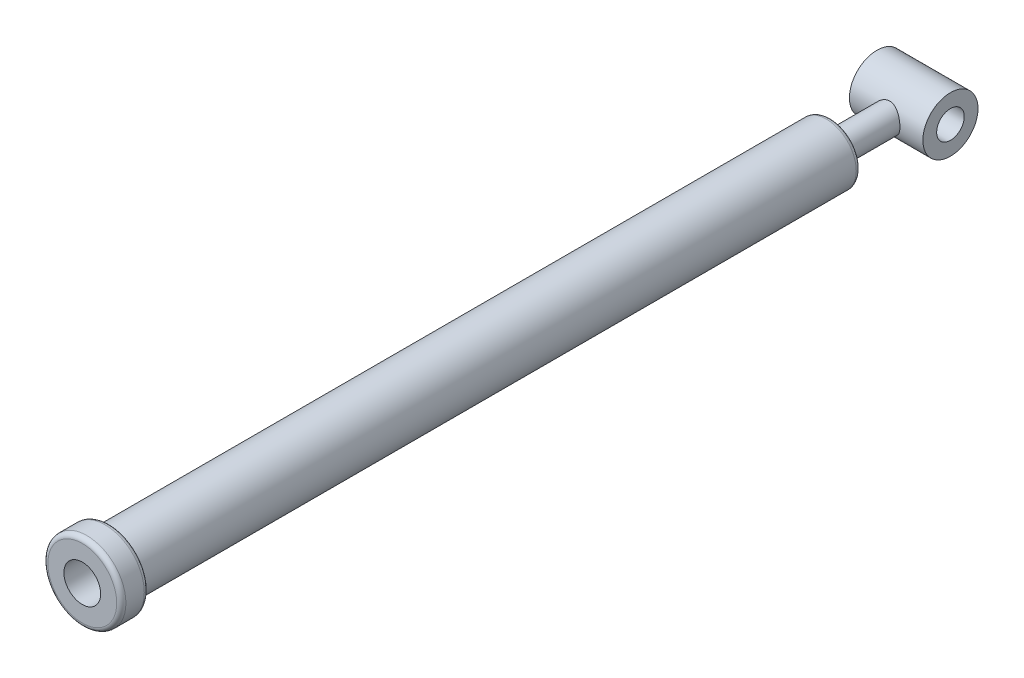
ISO-10303-21;
HEADER;
FILE_DESCRIPTION(('STEP AP214'),'2;1');
FILE_NAME('part.step','',(''),(''),'','','');
FILE_SCHEMA(('AUTOMOTIVE_DESIGN { 1 0 10303 214 1 1 1 1 }'));
ENDSEC;
DATA;
#1=APPLICATION_CONTEXT('core data for automotive mechanical design processes');
#2=APPLICATION_PROTOCOL_DEFINITION('international standard','automotive_design',2000,#1);
#3=PRODUCT_CONTEXT('',#1,'mechanical');
#4=PRODUCT('Part','Part','',(#3));
#5=PRODUCT_RELATED_PRODUCT_CATEGORY('part','',(#4));
#6=PRODUCT_DEFINITION_FORMATION('','',#4);
#7=PRODUCT_DEFINITION_CONTEXT('part definition',#1,'design');
#8=PRODUCT_DEFINITION('design','',#6,#7);
#9=PRODUCT_DEFINITION_SHAPE('','',#8);
#10=(LENGTH_UNIT() NAMED_UNIT(*) SI_UNIT(.MILLI.,.METRE.));
#11=(NAMED_UNIT(*) PLANE_ANGLE_UNIT() SI_UNIT($,.RADIAN.));
#12=(NAMED_UNIT(*) SI_UNIT($,.STERADIAN.) SOLID_ANGLE_UNIT());
#13=UNCERTAINTY_MEASURE_WITH_UNIT(LENGTH_MEASURE(1.E-05),#10,'distance_accuracy_value','');
#14=(GEOMETRIC_REPRESENTATION_CONTEXT(3) GLOBAL_UNCERTAINTY_ASSIGNED_CONTEXT((#13)) GLOBAL_UNIT_ASSIGNED_CONTEXT((#10,
#11,#12)) REPRESENTATION_CONTEXT('',''));
#15=CARTESIAN_POINT('',(0.,0.,0.));
#16=DIRECTION('',(0.,0.,1.));
#17=DIRECTION('',(1.,0.,0.));
#18=AXIS2_PLACEMENT_3D('',#15,#16,#17);
#19=CARTESIAN_POINT('',(0.,0.,-880.000000000001));
#20=DIRECTION('',(0.,0.,1.));
#21=DIRECTION('',(1.,0.,0.));
#22=AXIS2_PLACEMENT_3D('',#19,#20,#21);
#23=CYLINDRICAL_SURFACE('',#22,15.);
#24=CARTESIAN_POINT('',(0.,0.,-815.));
#25=DIRECTION('',(0.,0.,-1.));
#26=DIRECTION('',(-1.,0.,0.));
#27=AXIS2_PLACEMENT_3D('',#24,#25,#26);
#28=CIRCLE('',#27,15.);
#29=CARTESIAN_POINT('',(-15.,0.,-815.));
#30=VERTEX_POINT('',#29);
#31=EDGE_CURVE('E65',#30,#30,#28,.T.);
#32=ORIENTED_EDGE('',*,*,#31,.T.);
#33=EDGE_LOOP('',(#32));
#34=FACE_BOUND('',#33,.T.);
#35=CARTESIAN_POINT('',(15.,0.,-875.));
#36=CARTESIAN_POINT('',(14.9999986967893,-0.394466621474774,-875.000001198443));
#37=CARTESIAN_POINT('',(14.9844217290986,-0.788960822893598,-875.007798374442));
#38=CARTESIAN_POINT('',(14.9222912626951,-1.57504384672489,-875.038790696875));
#39=CARTESIAN_POINT('',(14.8757242881962,-1.96663133023565,-875.061992541912));
#40=CARTESIAN_POINT('',(14.752062134402,-2.74444839066597,-875.123245665513));
#41=CARTESIAN_POINT('',(14.674915671778,-3.13066783309047,-875.161321887591));
#42=CARTESIAN_POINT('',(14.4909926788045,-3.89427274204147,-875.251345482789));
#43=CARTESIAN_POINT('',(14.3842191117729,-4.27165908796738,-875.303291468628));
#44=CARTESIAN_POINT('',(14.1426464967422,-5.01370255233915,-875.419545464834));
#45=CARTESIAN_POINT('',(14.0079586988167,-5.37840368544458,-875.483804328684));
#46=CARTESIAN_POINT('',(13.7115835174738,-6.09447648128182,-875.623301187506));
#47=CARTESIAN_POINT('',(13.5498955527415,-6.44584785682342,-875.698539418861));
#48=CARTESIAN_POINT('',(13.2009461452605,-7.13327098283041,-875.858261390877));
#49=CARTESIAN_POINT('',(13.0136941461367,-7.4693283295993,-875.942741715133));
#50=CARTESIAN_POINT('',(12.6148696065897,-8.12479620523715,-876.119159593015));
#51=CARTESIAN_POINT('',(12.4032874777652,-8.44420009848104,-876.211100082431));
#52=CARTESIAN_POINT('',(11.9437431549207,-9.08356730455506,-876.406169485423));
#53=CARTESIAN_POINT('',(11.6943566948693,-9.40240338911197,-876.509638755959));
#54=CARTESIAN_POINT('',(11.1713323045258,-10.0182110858624,-876.720301058942));
#55=CARTESIAN_POINT('',(10.8976929878613,-10.3151814463611,-876.827494304051));
#56=CARTESIAN_POINT('',(10.32744213221,-10.8860835918351,-877.043134053405));
#57=CARTESIAN_POINT('',(10.0308163772597,-11.1600008976787,-877.151581297343));
#58=CARTESIAN_POINT('',(9.41609706949255,-11.6833254232374,-877.367048472575));
#59=CARTESIAN_POINT('',(9.09799950074795,-11.9327280363632,-877.474068132355));
#60=CARTESIAN_POINT('',(8.41621019135655,-12.424066666325,-877.692119687858));
#61=CARTESIAN_POINT('',(8.05089693128164,-12.6639084928373,-877.802814953087));
#62=CARTESIAN_POINT('',(7.29906225682786,-13.1116371457317,-878.01581142987));
#63=CARTESIAN_POINT('',(6.91254992484988,-13.3195375140209,-878.118116190042));
#64=CARTESIAN_POINT('',(6.12045119528939,-13.7015816677248,-878.310817756054));
#65=CARTESIAN_POINT('',(5.71487061752195,-13.8757356708103,-878.401218163611));
#66=CARTESIAN_POINT('',(4.88717106989482,-14.1884178363296,-878.566685065392));
#67=CARTESIAN_POINT('',(4.46505393858207,-14.3269499463523,-878.641753258529));
#68=CARTESIAN_POINT('',(3.63312743966091,-14.5593818816456,-878.769465636119));
#69=CARTESIAN_POINT('',(3.22409061692207,-14.6554546162323,-878.823181991672));
#70=CARTESIAN_POINT('',(2.3974253026042,-14.8131483158836,-878.912093372582));
#71=CARTESIAN_POINT('',(1.97979717934038,-14.874770754679,-878.947289190215));
#72=CARTESIAN_POINT('',(1.1399780978413,-14.9625716596024,-878.997615020556));
#73=CARTESIAN_POINT('',(0.717791304375857,-14.9887801055065,-879.012762005416));
#74=CARTESIAN_POINT('',(-0.127503752153197,-15.0054120092055,-879.022361014937));
#75=CARTESIAN_POINT('',(-0.550611923450829,-14.9958388811994,-879.016815014079));
#76=CARTESIAN_POINT('',(-1.34318604493256,-14.9443693637688,-878.987185469988));
#77=CARTESIAN_POINT('',(-1.7130074967434,-14.9064815133301,-878.965401642622));
#78=CARTESIAN_POINT('',(-2.44761394651885,-14.8036048078167,-878.906767299531));
#79=CARTESIAN_POINT('',(-2.81239941379462,-14.7386184959446,-878.869918197694));
#80=CARTESIAN_POINT('',(-3.53465011425935,-14.5822778462236,-878.782349877418));
#81=CARTESIAN_POINT('',(-3.8921134894694,-14.490916902454,-878.731627184298));
#82=CARTESIAN_POINT('',(-4.5975509702241,-14.2827793732036,-878.617879915435));
#83=CARTESIAN_POINT('',(-4.94552456919406,-14.1660014339124,-878.554854684429));
#84=CARTESIAN_POINT('',(-5.63806138553526,-13.9051185945145,-878.416735657269));
#85=CARTESIAN_POINT('',(-5.98236177926314,-13.7604466030275,-878.341397479624));
#86=CARTESIAN_POINT('',(-6.65764881287019,-13.4467240006949,-878.181786349804));
#87=CARTESIAN_POINT('',(-6.9886306367092,-13.2776646708395,-878.097510204974));
#88=CARTESIAN_POINT('',(-7.63583954119808,-12.9163207460711,-877.92216812122));
#89=CARTESIAN_POINT('',(-7.95206429387356,-12.724032503779,-877.831101116864));
#90=CARTESIAN_POINT('',(-8.56852275615351,-12.3173373374607,-877.644319137144));
#91=CARTESIAN_POINT('',(-8.86875518007753,-12.1029286391493,-877.548603789263));
#92=CARTESIAN_POINT('',(-9.4892135610555,-11.6244221009996,-877.342288154575));
#93=CARTESIAN_POINT('',(-9.80713018813409,-11.357472454083,-877.23134228918));
#94=CARTESIAN_POINT('',(-10.4195910602954,-10.7983337273758,-877.009171948652));
#95=CARTESIAN_POINT('',(-10.7141433900476,-10.5061534517949,-876.89794758375));
#96=CARTESIAN_POINT('',(-11.2787205781467,-9.89761910582897,-876.677890344788));
#97=CARTESIAN_POINT('',(-11.5487236024523,-9.58124396820905,-876.569059663621));
#98=CARTESIAN_POINT('',(-12.0621805278786,-8.92619254193717,-876.356648454253));
#99=CARTESIAN_POINT('',(-12.3056450163623,-8.58752523371366,-876.253065841263));
#100=CARTESIAN_POINT('',(-12.7751937974681,-7.87309152384946,-876.049027950799));
#101=CARTESIAN_POINT('',(-12.999931268877,-7.49633062281164,-875.94894596163));
#102=CARTESIAN_POINT('',(-13.4165538554255,-6.72229496746225,-875.760139769321));
#103=CARTESIAN_POINT('',(-13.608437440683,-6.32501925897374,-875.671416095144));
#104=CARTESIAN_POINT('',(-13.9571914545699,-5.51289034160744,-875.507976152199));
#105=CARTESIAN_POINT('',(-14.1140841452216,-5.09804850978522,-875.433250982128));
#106=CARTESIAN_POINT('',(-14.391076168471,-4.25373396764104,-875.300028469866));
#107=CARTESIAN_POINT('',(-14.5111797336915,-3.82426294674312,-875.241529260936));
#108=CARTESIAN_POINT('',(-14.7045987917793,-2.99040123124789,-875.146713024643));
#109=CARTESIAN_POINT('',(-14.780965864728,-2.58687987737183,-875.108959937919));
#110=CARTESIAN_POINT('',(-14.9004227368483,-1.77375891598894,-875.049709617987));
#111=CARTESIAN_POINT('',(-14.9435143460633,-1.36415964033065,-875.02821150058));
#112=CARTESIAN_POINT('',(-14.9958394822899,-0.542432179601619,-875.002088586177));
#113=CARTESIAN_POINT('',(-15.0050865466642,-0.130305071717037,-874.997457042784));
#114=CARTESIAN_POINT('',(-14.9896332143828,0.693142933067775,-875.005182902425));
#115=CARTESIAN_POINT('',(-14.9649343201033,1.10446386484084,-875.017539553599));
#116=CARTESIAN_POINT('',(-14.8851569218173,1.89104365716466,-875.057274299687));
#117=CARTESIAN_POINT('',(-14.8325856924447,2.26662317638414,-875.083411784036));
#118=CARTESIAN_POINT('',(-14.6994449555599,3.01155508953995,-875.149198828482));
#119=CARTESIAN_POINT('',(-14.6188772495211,3.38090788254089,-875.188847519178));
#120=CARTESIAN_POINT('',(-14.4305792041858,4.11102643115709,-875.280732355607));
#121=CARTESIAN_POINT('',(-14.322847354219,4.47179170797618,-875.332969201393));
#122=CARTESIAN_POINT('',(-14.0812572947496,5.18257720416893,-875.448848110263));
#123=CARTESIAN_POINT('',(-13.9473979874992,5.53259697135359,-875.51249065255));
#124=CARTESIAN_POINT('',(-13.6505393721982,6.22979935488015,-875.651753782207));
#125=CARTESIAN_POINT('',(-13.4868176517073,6.576616120173,-875.727664302393));
#126=CARTESIAN_POINT('',(-13.1343016754682,7.25508680349727,-875.888399600151));
#127=CARTESIAN_POINT('',(-12.9455071994249,7.58674058826881,-875.973224456043));
#128=CARTESIAN_POINT('',(-12.5441531585986,8.23341158684491,-876.149985850758));
#129=CARTESIAN_POINT('',(-12.3315897999932,8.54842613296244,-876.241923524154));
#130=CARTESIAN_POINT('',(-11.8839483671782,9.16054648853287,-876.431012285166));
#131=CARTESIAN_POINT('',(-11.6488615394066,9.45764526147817,-876.528165393215));
#132=CARTESIAN_POINT('',(-11.1333715012893,10.060839107335,-876.735341464201));
#133=CARTESIAN_POINT('',(-10.8507851186195,10.3649587307601,-876.845692143983));
#134=CARTESIAN_POINT('',(-10.2616154855625,10.9485707923032,-877.067469299411));
#135=CARTESIAN_POINT('',(-9.9550311697726,11.2280621358615,-877.178895822627));
#136=CARTESIAN_POINT('',(-9.31919419442999,11.761157874002,-877.400027289832));
#137=CARTESIAN_POINT('',(-8.98992792709478,12.0147464980315,-877.50973115101));
#138=CARTESIAN_POINT('',(-8.31037887445767,12.4944228999317,-877.724397948994));
#139=CARTESIAN_POINT('',(-7.96009249191951,12.7205059505332,-877.829360068913));
#140=CARTESIAN_POINT('',(-7.22261605950783,13.1539172060939,-878.036414537209));
#141=CARTESIAN_POINT('',(-6.83445930863627,13.3597919511091,-878.138116937489));
#142=CARTESIAN_POINT('',(-6.03927850598328,13.737567232961,-878.329340387484));
#143=CARTESIAN_POINT('',(-5.63226376216402,13.9094843147169,-878.418867362678));
#144=CARTESIAN_POINT('',(-4.80217565091482,14.2174151642657,-878.582288068273));
#145=CARTESIAN_POINT('',(-4.37911544662186,14.353457663537,-878.656194299646));
#146=CARTESIAN_POINT('',(-3.51992505793521,14.5879514095295,-878.785315987481));
#147=CARTESIAN_POINT('',(-3.08379690851378,14.6864084766722,-878.840534337768));
#148=CARTESIAN_POINT('',(-2.24471283239244,14.8366134509912,-878.925460869572));
#149=CARTESIAN_POINT('',(-1.84259137531863,14.8919378625023,-878.957109030588));
#150=CARTESIAN_POINT('',(-1.0341590037221,14.9698153891526,-879.0017947784));
#151=CARTESIAN_POINT('',(-0.627848376009428,14.9923707330054,-879.014833630864));
#152=CARTESIAN_POINT('',(0.185270351507968,15.0043645010929,-879.02175736532));
#153=CARTESIAN_POINT('',(0.592078211651152,14.9938151743778,-879.015649331846));
#154=CARTESIAN_POINT('',(1.40275816467971,14.9397884815991,-878.984549012312));
#155=CARTESIAN_POINT('',(1.80663037706581,14.8963124635393,-878.959557499333));
#156=CARTESIAN_POINT('',(2.56967168244059,14.782795841076,-878.894967278987));
#157=CARTESIAN_POINT('',(2.92942204471818,14.7156934571528,-878.856994150101));
#158=CARTESIAN_POINT('',(3.64159381579529,14.5558242789108,-878.767646667705));
#159=CARTESIAN_POINT('',(3.99401275857395,14.4630489945772,-878.716267881271));
#160=CARTESIAN_POINT('',(4.68939648000362,14.2527724980854,-878.601651711384));
#161=CARTESIAN_POINT('',(5.0323611460618,14.1352709916016,-878.538414186773));
#162=CARTESIAN_POINT('',(5.70716431681701,13.8765585244577,-878.401832636467));
#163=CARTESIAN_POINT('',(6.0390017228925,13.7353452308956,-878.328487616466));
#164=CARTESIAN_POINT('',(6.71194905721808,13.4200195538921,-878.168369544421));
#165=CARTESIAN_POINT('',(7.05218633738287,13.2443351386714,-878.081025622916));
#166=CARTESIAN_POINT('',(7.71683729888767,12.8684192321827,-877.899310742733));
#167=CARTESIAN_POINT('',(8.04125049766908,12.6681869929773,-877.804939569978));
#168=CARTESIAN_POINT('',(8.67307599887717,12.2442855818538,-877.611466647555));
#169=CARTESIAN_POINT('',(8.9804818359264,12.0206075892618,-877.512363125189));
#170=CARTESIAN_POINT('',(9.57700095794095,11.5509819278367,-877.311734819274));
#171=CARTESIAN_POINT('',(9.86611149224955,11.3050309237573,-877.210209674786));
#172=CARTESIAN_POINT('',(10.4588881043877,10.7607009160988,-876.994588016577));
#173=CARTESIAN_POINT('',(10.7600384098886,10.4595848725634,-876.880466375822));
#174=CARTESIAN_POINT('',(11.3360350079751,9.83237263592984,-876.655062843985));
#175=CARTESIAN_POINT('',(11.6108894699081,9.50628425805799,-876.543780078879));
#176=CARTESIAN_POINT('',(12.1328673274452,8.83040064495091,-876.326840554529));
#177=CARTESIAN_POINT('',(12.3799686513199,8.48058689086185,-876.221188307768));
#178=CARTESIAN_POINT('',(12.8443186951047,7.75934315416603,-876.018404213272));
#179=CARTESIAN_POINT('',(13.0615691351246,7.38791441884538,-875.921271874707));
#180=CARTESIAN_POINT('',(13.4657554418474,6.62283359834588,-875.737499586337));
#181=CARTESIAN_POINT('',(13.652463307469,6.22904153096558,-875.650939674485));
#182=CARTESIAN_POINT('',(13.9917304392215,5.42422205013374,-875.491593102566));
#183=CARTESIAN_POINT('',(14.1442848128173,5.01319217734313,-875.41880841605));
#184=CARTESIAN_POINT('',(14.4130312534336,4.17809175418138,-875.289368363161));
#185=CARTESIAN_POINT('',(14.52931393542,3.75405665560561,-875.232672834932));
#186=CARTESIAN_POINT('',(14.7244141315277,2.89570983328148,-875.136960690795));
#187=CARTESIAN_POINT('',(14.8032545313493,2.46140455781254,-875.097933276359));
#188=CARTESIAN_POINT('',(14.9084233559045,1.68912528485808,-875.04570850057));
#189=CARTESIAN_POINT('',(14.9427351996439,1.35247752005867,-875.028597786956));
#190=CARTESIAN_POINT('',(14.9885243961843,0.677226647280003,-875.005742865413));
#191=CARTESIAN_POINT('',(15.0000011187201,0.338623485589113,-874.999998971216));
#192=CARTESIAN_POINT('',(15.,0.,-875.));
#193=B_SPLINE_CURVE_WITH_KNOTS('',3,(#35,#36,#37,#38,#39,#40,#41,#42,#43,#44,#45,#46,#47,#48,
#49,#50,#51,#52,#53,#54,#55,#56,#57,#58,#59,#60,#61,#62,#63,#64,#65,#66,#67,#68,#69,#70,#71,#72,
#73,#74,#75,#76,#77,#78,#79,#80,#81,#82,#83,#84,#85,#86,#87,#88,#89,#90,#91,#92,#93,#94,#95,#96,
#97,#98,#99,#100,#101,#102,#103,#104,#105,#106,#107,#108,#109,#110,#111,#112,#113,#114,#115,
#116,#117,#118,#119,#120,#121,#122,#123,#124,#125,#126,#127,#128,#129,#130,#131,#132,#133,#134,
#135,#136,#137,#138,#139,#140,#141,#142,#143,#144,#145,#146,#147,#148,#149,#150,#151,#152,#153,
#154,#155,#156,#157,#158,#159,#160,#161,#162,#163,#164,#165,#166,#167,#168,#169,#170,#171,#172,
#173,#174,#175,#176,#177,#178,#179,#180,#181,#182,#183,#184,#185,#186,#187,#188,#189,#190,#191,
#192),.UNSPECIFIED.,.T.,.F.,(4,2,2,2,2,2,2,2,2,2,2,2,2,2,2,2,2,2,2,2,2,2,2,2,2,2,2,2,2,2,2,2,2,
2,2,2,2,2,2,2,2,2,2,2,2,2,2,2,2,2,2,2,2,2,2,2,2,2,2,2,2,2,2,2,2,2,2,2,2,2,2,2,2,2,2,2,2,2,4),
(0.,1.1830658838765,2.36664655205927,3.55222059958419,4.73767610811696,5.91849492154762,
7.09933916134024,8.27974835920213,9.46062435602728,10.7126941080732,11.9648354787241,
13.2177575130875,14.4709145374422,15.821667201721,17.1718456109054,18.521614574237,
19.8712338927467,21.1401798733571,22.4090715662491,23.6768884023223,24.9445842691984,
26.0604534443427,27.1762179182402,28.2922620948529,29.4083657309785,30.550157382565,
31.6923582661887,32.8347387306652,33.9772108970053,35.2649000045823,36.5521415758273,
37.8405170382692,39.1283766165387,40.4765138704575,41.824713885002,43.1720536807209,
44.519238405488,45.7548292237563,46.9903528264139,48.2253821822106,49.4603568799793,
50.5994583371908,51.7384865108584,52.8775780428886,54.0167174442702,55.1883567290371,
56.3600063087792,57.5318431666801,58.7041373111916,59.9914055352965,61.2787309408957,
62.5668355046821,63.8551611378706,65.2063513889893,66.5568816778175,67.9063270370393,
69.2555633384068,70.4752824018563,71.6949185050053,72.9141033841497,74.1332383531126,
75.2357784731185,76.3386836391977,77.4416019343193,78.5446288045349,79.7216927437009,
80.8987925552603,82.0763368112874,83.2540576898123,84.5752168212047,85.8959641652359,
87.217754555028,88.5394687467831,89.8706389488175,91.2019997209938,92.5300073067729,
93.8572021316087,94.872757858524,95.8883416150965),.UNSPECIFIED.);
#194=CARTESIAN_POINT('',(15.,0.,-875.));
#195=VERTEX_POINT('',#194);
#196=EDGE_CURVE('E57',#195,#195,#193,.T.);
#197=ORIENTED_EDGE('',*,*,#196,.F.);
#198=EDGE_LOOP('',(#197));
#199=FACE_BOUND('',#198,.T.);
#200=ADVANCED_FACE('F31',(#34,#199),#23,.T.);
#201=CARTESIAN_POINT('',(0.,0.,-30.));
#202=DIRECTION('',(0.,0.,1.));
#203=DIRECTION('',(1.,0.,0.));
#204=AXIS2_PLACEMENT_3D('',#201,#202,#203);
#205=PLANE('',#204);
#206=CARTESIAN_POINT('',(0.,0.,-30.));
#207=DIRECTION('',(0.,0.,1.));
#208=DIRECTION('',(1.,0.,0.));
#209=AXIS2_PLACEMENT_3D('',#206,#207,#208);
#210=CIRCLE('',#209,37.5);
#211=CARTESIAN_POINT('',(37.5,0.,-30.));
#212=VERTEX_POINT('',#211);
#213=EDGE_CURVE('E42',#212,#212,#210,.F.);
#214=ORIENTED_EDGE('',*,*,#213,.T.);
#215=EDGE_LOOP('',(#214));
#216=FACE_BOUND('',#215,.T.);
#217=CARTESIAN_POINT('',(0.,0.,-30.));
#218=DIRECTION('',(0.,0.,1.));
#219=DIRECTION('',(1.,0.,0.));
#220=AXIS2_PLACEMENT_3D('',#217,#218,#219);
#221=CIRCLE('',#220,32.5);
#222=CARTESIAN_POINT('',(32.5,0.,-30.));
#223=VERTEX_POINT('',#222);
#224=EDGE_CURVE('E66',#223,#223,#221,.F.);
#225=ORIENTED_EDGE('',*,*,#224,.F.);
#226=EDGE_LOOP('',(#225));
#227=FACE_BOUND('',#226,.T.);
#228=ADVANCED_FACE('F97',(#216,#227),#205,.F.);
#229=CARTESIAN_POINT('',(0.,0.,-30.));
#230=DIRECTION('',(0.,0.,1.));
#231=DIRECTION('',(1.,0.,0.));
#232=AXIS2_PLACEMENT_3D('',#229,#230,#231);
#233=CYLINDRICAL_SURFACE('',#232,42.5);
#234=CARTESIAN_POINT('',(0.,0.,-5.));
#235=DIRECTION('',(0.,0.,1.));
#236=DIRECTION('',(1.,0.,0.));
#237=AXIS2_PLACEMENT_3D('',#234,#235,#236);
#238=CIRCLE('',#237,42.5);
#239=CARTESIAN_POINT('',(42.5,0.,-5.));
#240=VERTEX_POINT('',#239);
#241=EDGE_CURVE('E46',#240,#240,#238,.F.);
#242=ORIENTED_EDGE('',*,*,#241,.T.);
#243=EDGE_LOOP('',(#242));
#244=FACE_BOUND('',#243,.T.);
#245=CARTESIAN_POINT('',(0.,0.,-25.));
#246=DIRECTION('',(0.,0.,1.));
#247=DIRECTION('',(1.,0.,0.));
#248=AXIS2_PLACEMENT_3D('',#245,#246,#247);
#249=CIRCLE('',#248,42.5);
#250=CARTESIAN_POINT('',(42.5,0.,-25.));
#251=VERTEX_POINT('',#250);
#252=EDGE_CURVE('E51',#251,#251,#249,.T.);
#253=ORIENTED_EDGE('',*,*,#252,.T.);
#254=EDGE_LOOP('',(#253));
#255=FACE_BOUND('',#254,.T.);
#256=ADVANCED_FACE('F102',(#244,#255),#233,.T.);
#257=CARTESIAN_POINT('',(0.,0.,0.));
#258=DIRECTION('',(0.,0.,1.));
#259=DIRECTION('',(1.,0.,0.));
#260=AXIS2_PLACEMENT_3D('',#257,#258,#259);
#261=PLANE('',#260);
#262=CARTESIAN_POINT('',(0.,0.,0.));
#263=DIRECTION('',(0.,0.,1.));
#264=DIRECTION('',(1.,0.,0.));
#265=AXIS2_PLACEMENT_3D('',#262,#263,#264);
#266=CIRCLE('',#265,37.5);
#267=CARTESIAN_POINT('',(37.5,0.,0.));
#268=VERTEX_POINT('',#267);
#269=EDGE_CURVE('E54',#268,#268,#266,.T.);
#270=ORIENTED_EDGE('',*,*,#269,.T.);
#271=EDGE_LOOP('',(#270));
#272=FACE_BOUND('',#271,.T.);
#273=CARTESIAN_POINT('',(0.,0.,0.));
#274=DIRECTION('',(0.,0.,1.));
#275=DIRECTION('',(1.,0.,0.));
#276=AXIS2_PLACEMENT_3D('',#273,#274,#275);
#277=CIRCLE('',#276,20.);
#278=CARTESIAN_POINT('',(20.,0.,0.));
#279=VERTEX_POINT('',#278);
#280=EDGE_CURVE('E113',#279,#279,#277,.T.);
#281=ORIENTED_EDGE('',*,*,#280,.F.);
#282=EDGE_LOOP('',(#281));
#283=FACE_BOUND('',#282,.T.);
#284=ADVANCED_FACE('F127',(#272,#283),#261,.T.);
#285=CARTESIAN_POINT('',(0.,0.,-30.));
#286=DIRECTION('',(0.,0.,1.));
#287=DIRECTION('',(1.,0.,0.));
#288=AXIS2_PLACEMENT_3D('',#285,#286,#287);
#289=CYLINDRICAL_SURFACE('',#288,20.);
#290=ORIENTED_EDGE('',*,*,#280,.T.);
#291=EDGE_LOOP('',(#290));
#292=FACE_BOUND('',#291,.T.);
#293=CARTESIAN_POINT('',(0.,0.,-810.));
#294=DIRECTION('',(0.,0.,-1.));
#295=DIRECTION('',(-1.,0.,0.));
#296=AXIS2_PLACEMENT_3D('',#293,#294,#295);
#297=CIRCLE('',#296,20.);
#298=CARTESIAN_POINT('',(-20.,0.,-810.));
#299=VERTEX_POINT('',#298);
#300=EDGE_CURVE('E118',#299,#299,#297,.T.);
#301=ORIENTED_EDGE('',*,*,#300,.T.);
#302=EDGE_LOOP('',(#301));
#303=FACE_BOUND('',#302,.T.);
#304=ADVANCED_FACE('F124',(#292,#303),#289,.F.);
#305=CARTESIAN_POINT('',(0.,0.,-810.));
#306=DIRECTION('',(0.,0.,1.));
#307=DIRECTION('',(1.,0.,0.));
#308=AXIS2_PLACEMENT_3D('',#305,#306,#307);
#309=CYLINDRICAL_SURFACE('',#308,32.5);
#310=CARTESIAN_POINT('',(0.,0.,-810.));
#311=DIRECTION('',(0.,0.,-1.));
#312=DIRECTION('',(-1.,0.,0.));
#313=AXIS2_PLACEMENT_3D('',#310,#311,#312);
#314=CIRCLE('',#313,32.5);
#315=CARTESIAN_POINT('',(-32.5,0.,-810.));
#316=VERTEX_POINT('',#315);
#317=EDGE_CURVE('E10',#316,#316,#314,.F.);
#318=ORIENTED_EDGE('',*,*,#317,.T.);
#319=EDGE_LOOP('',(#318));
#320=FACE_BOUND('',#319,.T.);
#321=ORIENTED_EDGE('',*,*,#224,.T.);
#322=EDGE_LOOP('',(#321));
#323=FACE_BOUND('',#322,.T.);
#324=ADVANCED_FACE('F135',(#320,#323),#309,.T.);
#325=CARTESIAN_POINT('',(0.,0.,-810.));
#326=DIRECTION('',(0.,0.,-1.));
#327=DIRECTION('',(-1.,0.,0.));
#328=AXIS2_PLACEMENT_3D('',#325,#326,#327);
#329=PLANE('',#328);
#330=ORIENTED_EDGE('',*,*,#300,.F.);
#331=EDGE_LOOP('',(#330));
#332=FACE_BOUND('',#331,.T.);
#333=ADVANCED_FACE('F153',(#332),#329,.F.);
#334=CARTESIAN_POINT('',(0.,0.,-815.));
#335=DIRECTION('',(0.,0.,-1.));
#336=DIRECTION('',(-1.,0.,0.));
#337=AXIS2_PLACEMENT_3D('',#334,#335,#336);
#338=PLANE('',#337);
#339=CARTESIAN_POINT('',(0.,0.,-815.));
#340=DIRECTION('',(0.,0.,-1.));
#341=DIRECTION('',(-1.,0.,0.));
#342=AXIS2_PLACEMENT_3D('',#339,#340,#341);
#343=CIRCLE('',#342,27.5);
#344=CARTESIAN_POINT('',(-27.5,0.,-815.));
#345=VERTEX_POINT('',#344);
#346=EDGE_CURVE('E38',#345,#345,#343,.T.);
#347=ORIENTED_EDGE('',*,*,#346,.T.);
#348=EDGE_LOOP('',(#347));
#349=FACE_BOUND('',#348,.T.);
#350=ORIENTED_EDGE('',*,*,#31,.F.);
#351=EDGE_LOOP('',(#350));
#352=FACE_BOUND('',#351,.T.);
#353=ADVANCED_FACE('F75',(#349,#352),#338,.T.);
#354=CARTESIAN_POINT('',(40.,0.,-905.));
#355=DIRECTION('',(-1.,0.,0.));
#356=DIRECTION('',(0.,0.,1.));
#357=AXIS2_PLACEMENT_3D('',#354,#355,#356);
#358=CYLINDRICAL_SURFACE('',#357,30.);
#359=CARTESIAN_POINT('',(-40.,0.,-905.));
#360=DIRECTION('',(1.,0.,0.));
#361=DIRECTION('',(0.,0.,-1.));
#362=AXIS2_PLACEMENT_3D('',#359,#360,#361);
#363=CIRCLE('',#362,30.);
#364=CARTESIAN_POINT('',(-40.,0.,-935.));
#365=VERTEX_POINT('',#364);
#366=EDGE_CURVE('E116',#365,#365,#363,.T.);
#367=ORIENTED_EDGE('',*,*,#366,.T.);
#368=EDGE_LOOP('',(#367));
#369=FACE_BOUND('',#368,.T.);
#370=CARTESIAN_POINT('',(40.,0.,-905.));
#371=DIRECTION('',(1.,0.,0.));
#372=DIRECTION('',(0.,0.,-1.));
#373=AXIS2_PLACEMENT_3D('',#370,#371,#372);
#374=CIRCLE('',#373,30.);
#375=CARTESIAN_POINT('',(40.,0.,-935.));
#376=VERTEX_POINT('',#375);
#377=EDGE_CURVE('E120',#376,#376,#374,.T.);
#378=ORIENTED_EDGE('',*,*,#377,.F.);
#379=EDGE_LOOP('',(#378));
#380=FACE_BOUND('',#379,.T.);
#381=ORIENTED_EDGE('',*,*,#196,.T.);
#382=EDGE_LOOP('',(#381));
#383=FACE_BOUND('',#382,.T.);
#384=ADVANCED_FACE('F70',(#369,#380,#383),#358,.T.);
#385=CARTESIAN_POINT('',(40.,0.,-905.));
#386=DIRECTION('',(1.,0.,0.));
#387=DIRECTION('',(0.,0.,-1.));
#388=AXIS2_PLACEMENT_3D('',#385,#386,#387);
#389=PLANE('',#388);
#390=ORIENTED_EDGE('',*,*,#377,.T.);
#391=EDGE_LOOP('',(#390));
#392=FACE_BOUND('',#391,.T.);
#393=CARTESIAN_POINT('',(40.,0.,-905.));
#394=DIRECTION('',(1.,0.,0.));
#395=DIRECTION('',(0.,0.,-1.));
#396=AXIS2_PLACEMENT_3D('',#393,#394,#395);
#397=CIRCLE('',#396,15.);
#398=CARTESIAN_POINT('',(40.,0.,-920.));
#399=VERTEX_POINT('',#398);
#400=EDGE_CURVE('E255',#399,#399,#397,.T.);
#401=ORIENTED_EDGE('',*,*,#400,.F.);
#402=EDGE_LOOP('',(#401));
#403=FACE_BOUND('',#402,.T.);
#404=ADVANCED_FACE('F74',(#392,#403),#389,.T.);
#405=CARTESIAN_POINT('',(-40.,0.,-905.));
#406=DIRECTION('',(1.,0.,0.));
#407=DIRECTION('',(0.,0.,-1.));
#408=AXIS2_PLACEMENT_3D('',#405,#406,#407);
#409=PLANE('',#408);
#410=ORIENTED_EDGE('',*,*,#366,.F.);
#411=EDGE_LOOP('',(#410));
#412=FACE_BOUND('',#411,.T.);
#413=CARTESIAN_POINT('',(-40.,0.,-905.));
#414=DIRECTION('',(1.,0.,0.));
#415=DIRECTION('',(0.,0.,-1.));
#416=AXIS2_PLACEMENT_3D('',#413,#414,#415);
#417=CIRCLE('',#416,15.);
#418=CARTESIAN_POINT('',(-40.,0.,-920.));
#419=VERTEX_POINT('',#418);
#420=EDGE_CURVE('E257',#419,#419,#417,.T.);
#421=ORIENTED_EDGE('',*,*,#420,.T.);
#422=EDGE_LOOP('',(#421));
#423=FACE_BOUND('',#422,.T.);
#424=ADVANCED_FACE('F77',(#412,#423),#409,.F.);
#425=CARTESIAN_POINT('',(40.,0.,-905.));
#426=DIRECTION('',(-1.,0.,0.));
#427=DIRECTION('',(0.,0.,1.));
#428=AXIS2_PLACEMENT_3D('',#425,#426,#427);
#429=CYLINDRICAL_SURFACE('',#428,15.);
#430=ORIENTED_EDGE('',*,*,#400,.T.);
#431=EDGE_LOOP('',(#430));
#432=FACE_BOUND('',#431,.T.);
#433=ORIENTED_EDGE('',*,*,#420,.F.);
#434=EDGE_LOOP('',(#433));
#435=FACE_BOUND('',#434,.T.);
#436=ADVANCED_FACE('F80',(#432,#435),#429,.F.);
#437=CARTESIAN_POINT('',(0.,0.,-5.));
#438=DIRECTION('',(0.,0.,1.));
#439=DIRECTION('',(1.,0.,0.));
#440=AXIS2_PLACEMENT_3D('',#437,#438,#439);
#441=TOROIDAL_SURFACE('',#440,37.5,5.);
#442=ORIENTED_EDGE('',*,*,#241,.F.);
#443=EDGE_LOOP('',(#442));
#444=FACE_BOUND('',#443,.T.);
#445=ORIENTED_EDGE('',*,*,#269,.F.);
#446=EDGE_LOOP('',(#445));
#447=FACE_BOUND('',#446,.T.);
#448=ADVANCED_FACE('F86',(#444,#447),#441,.T.);
#449=CARTESIAN_POINT('',(0.,0.,-25.));
#450=DIRECTION('',(0.,0.,1.));
#451=DIRECTION('',(1.,0.,0.));
#452=AXIS2_PLACEMENT_3D('',#449,#450,#451);
#453=TOROIDAL_SURFACE('',#452,37.5,5.);
#454=ORIENTED_EDGE('',*,*,#213,.F.);
#455=EDGE_LOOP('',(#454));
#456=FACE_BOUND('',#455,.T.);
#457=ORIENTED_EDGE('',*,*,#252,.F.);
#458=EDGE_LOOP('',(#457));
#459=FACE_BOUND('',#458,.T.);
#460=ADVANCED_FACE('F91',(#456,#459),#453,.T.);
#461=CARTESIAN_POINT('',(0.,0.,-810.));
#462=DIRECTION('',(0.,0.,-1.));
#463=DIRECTION('',(-1.,0.,0.));
#464=AXIS2_PLACEMENT_3D('',#461,#462,#463);
#465=TOROIDAL_SURFACE('',#464,27.5,5.);
#466=ORIENTED_EDGE('',*,*,#317,.F.);
#467=EDGE_LOOP('',(#466));
#468=FACE_BOUND('',#467,.T.);
#469=ORIENTED_EDGE('',*,*,#346,.F.);
#470=EDGE_LOOP('',(#469));
#471=FACE_BOUND('',#470,.T.);
#472=ADVANCED_FACE('F33',(#468,#471),#465,.T.);
#473=CLOSED_SHELL('',(#200,#228,#256,#284,#304,#324,#333,#353,#384,#404,#424,#436,#448,#460,#472));
#474=MANIFOLD_SOLID_BREP('B2',#473);
#475=ADVANCED_BREP_SHAPE_REPRESENTATION('',(#18,#474),#14);
#476=SHAPE_DEFINITION_REPRESENTATION(#9,#475);
ENDSEC;
END-ISO-10303-21;
